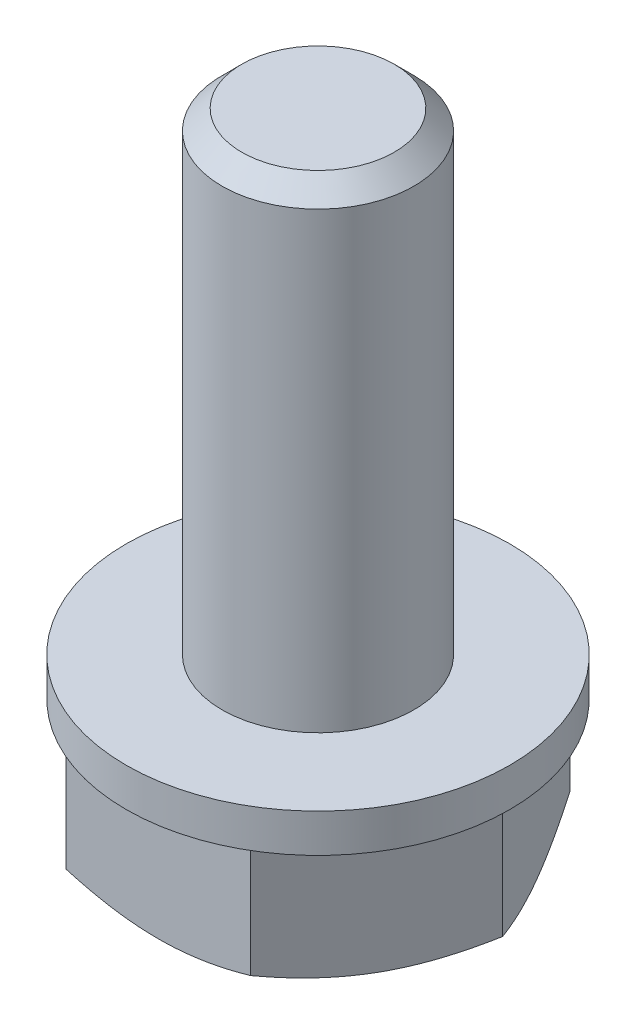
ISO-10303-21;
HEADER;
FILE_DESCRIPTION(('STEP AP214'),'2;1');
FILE_NAME('part.step','',(''),(''),'','','');
FILE_SCHEMA(('AUTOMOTIVE_DESIGN { 1 0 10303 214 1 1 1 1 }'));
ENDSEC;
DATA;
#1=APPLICATION_CONTEXT('core data for automotive mechanical design processes');
#2=APPLICATION_PROTOCOL_DEFINITION('international standard','automotive_design',2000,#1);
#3=PRODUCT_CONTEXT('',#1,'mechanical');
#4=PRODUCT('Part','Part','',(#3));
#5=PRODUCT_RELATED_PRODUCT_CATEGORY('part','',(#4));
#6=PRODUCT_DEFINITION_FORMATION('','',#4);
#7=PRODUCT_DEFINITION_CONTEXT('part definition',#1,'design');
#8=PRODUCT_DEFINITION('design','',#6,#7);
#9=PRODUCT_DEFINITION_SHAPE('','',#8);
#10=(LENGTH_UNIT() NAMED_UNIT(*) SI_UNIT(.MILLI.,.METRE.));
#11=(NAMED_UNIT(*) PLANE_ANGLE_UNIT() SI_UNIT($,.RADIAN.));
#12=(NAMED_UNIT(*) SI_UNIT($,.STERADIAN.) SOLID_ANGLE_UNIT());
#13=UNCERTAINTY_MEASURE_WITH_UNIT(LENGTH_MEASURE(1.E-05),#10,'distance_accuracy_value','');
#14=(GEOMETRIC_REPRESENTATION_CONTEXT(3) GLOBAL_UNCERTAINTY_ASSIGNED_CONTEXT((#13)) GLOBAL_UNIT_ASSIGNED_CONTEXT((#10,
#11,#12)) REPRESENTATION_CONTEXT('',''));
#15=CARTESIAN_POINT('',(0.,0.,0.));
#16=DIRECTION('',(0.,0.,1.));
#17=DIRECTION('',(1.,0.,0.));
#18=AXIS2_PLACEMENT_3D('',#15,#16,#17);
#19=CARTESIAN_POINT('',(17.677669529664,-54.8,15.177669529664));
#20=DIRECTION('',(0.,-1.,0.));
#21=DIRECTION('',(0.,0.,-1.));
#22=AXIS2_PLACEMENT_3D('',#19,#20,#21);
#23=PLANE('',#22);
#24=CARTESIAN_POINT('',(17.677669529664,-54.8,17.677669529664));
#25=DIRECTION('',(0.,-1.,0.));
#26=DIRECTION('',(0.,0.,-1.));
#27=AXIS2_PLACEMENT_3D('',#24,#25,#26);
#28=CIRCLE('',#27,5.);
#29=CARTESIAN_POINT('',(17.677669529664,-54.8,12.677669529664));
#30=VERTEX_POINT('',#29);
#31=CARTESIAN_POINT('',(22.0077965485861,-54.8,15.1776695296639));
#32=VERTEX_POINT('',#31);
#33=EDGE_CURVE('E106',#30,#32,#28,.T.);
#34=ORIENTED_EDGE('',*,*,#33,.T.);
#35=CARTESIAN_POINT('',(17.677669529664,-54.8,17.677669529664));
#36=DIRECTION('',(0.,-1.,0.));
#37=DIRECTION('',(0.,0.,-1.));
#38=AXIS2_PLACEMENT_3D('',#35,#36,#37);
#39=CIRCLE('',#38,5.);
#40=CARTESIAN_POINT('',(22.0077965485861,-54.8,20.1776695296641));
#41=VERTEX_POINT('',#40);
#42=EDGE_CURVE('E95',#32,#41,#39,.T.);
#43=ORIENTED_EDGE('',*,*,#42,.T.);
#44=CARTESIAN_POINT('',(17.677669529664,-54.8,17.677669529664));
#45=DIRECTION('',(0.,-1.,0.));
#46=DIRECTION('',(0.,0.,-1.));
#47=AXIS2_PLACEMENT_3D('',#44,#45,#46);
#48=CIRCLE('',#47,5.);
#49=CARTESIAN_POINT('',(17.677669529664,-54.8,22.677669529664));
#50=VERTEX_POINT('',#49);
#51=EDGE_CURVE('E164',#41,#50,#48,.T.);
#52=ORIENTED_EDGE('',*,*,#51,.T.);
#53=CARTESIAN_POINT('',(17.677669529664,-54.8,17.677669529664));
#54=DIRECTION('',(0.,-1.,0.));
#55=DIRECTION('',(0.,0.,-1.));
#56=AXIS2_PLACEMENT_3D('',#53,#54,#55);
#57=CIRCLE('',#56,5.);
#58=CARTESIAN_POINT('',(13.3475425107418,-54.8,20.1776695296641));
#59=VERTEX_POINT('',#58);
#60=EDGE_CURVE('E79',#50,#59,#57,.T.);
#61=ORIENTED_EDGE('',*,*,#60,.T.);
#62=CARTESIAN_POINT('',(17.677669529664,-54.8,17.677669529664));
#63=DIRECTION('',(0.,-1.,0.));
#64=DIRECTION('',(0.,0.,-1.));
#65=AXIS2_PLACEMENT_3D('',#62,#63,#64);
#66=CIRCLE('',#65,5.);
#67=CARTESIAN_POINT('',(13.3475425107418,-54.8,15.1776695296639));
#68=VERTEX_POINT('',#67);
#69=EDGE_CURVE('E172',#59,#68,#66,.T.);
#70=ORIENTED_EDGE('',*,*,#69,.T.);
#71=CARTESIAN_POINT('',(17.677669529664,-54.8,17.677669529664));
#72=DIRECTION('',(0.,-1.,0.));
#73=DIRECTION('',(0.,0.,-1.));
#74=AXIS2_PLACEMENT_3D('',#71,#72,#73);
#75=CIRCLE('',#74,5.);
#76=EDGE_CURVE('E177',#68,#30,#75,.T.);
#77=ORIENTED_EDGE('',*,*,#76,.T.);
#78=EDGE_LOOP('',(#34,#43,#52,#61,#70,#77));
#79=FACE_BOUND('',#78,.T.);
#80=ADVANCED_FACE('F16',(#79),#23,.T.);
#81=CARTESIAN_POINT('',(17.677669529664,-51.9113248654052,17.677669529664));
#82=DIRECTION('',(0.,1.,0.));
#83=DIRECTION('',(0.,0.,-1.));
#84=AXIS2_PLACEMENT_3D('',#81,#82,#83);
#85=CYLINDRICAL_SURFACE('',#84,6.);
#86=CARTESIAN_POINT('',(17.677669529664,-49.6,17.677669529664));
#87=DIRECTION('',(0.,-1.,0.));
#88=DIRECTION('',(0.,0.,-1.));
#89=AXIS2_PLACEMENT_3D('',#86,#87,#88);
#90=CIRCLE('',#89,6.);
#91=CARTESIAN_POINT('',(17.677669529664,-49.6,11.677669529664));
#92=VERTEX_POINT('',#91);
#93=EDGE_CURVE('E11',#92,#92,#90,.T.);
#94=ORIENTED_EDGE('',*,*,#93,.T.);
#95=EDGE_LOOP('',(#94));
#96=FACE_BOUND('',#95,.T.);
#97=CARTESIAN_POINT('',(17.677669529664,-50.8,17.677669529664));
#98=DIRECTION('',(0.,1.,0.));
#99=DIRECTION('',(0.,0.,-1.));
#100=AXIS2_PLACEMENT_3D('',#97,#98,#99);
#101=CIRCLE('',#100,6.);
#102=CARTESIAN_POINT('',(17.677669529664,-50.8,11.677669529664));
#103=VERTEX_POINT('',#102);
#104=EDGE_CURVE('E171',#103,#103,#101,.T.);
#105=ORIENTED_EDGE('',*,*,#104,.T.);
#106=EDGE_LOOP('',(#105));
#107=FACE_BOUND('',#106,.T.);
#108=ADVANCED_FACE('F294',(#96,#107),#85,.T.);
#109=CARTESIAN_POINT('',(17.677669529664,-49.6,13.177669529664));
#110=DIRECTION('',(0.,1.,0.));
#111=DIRECTION('',(0.,0.,1.));
#112=AXIS2_PLACEMENT_3D('',#109,#110,#111);
#113=PLANE('',#112);
#114=CARTESIAN_POINT('',(17.677669529664,-49.6,17.677669529664));
#115=DIRECTION('',(0.,-1.,0.));
#116=DIRECTION('',(0.,0.,-1.));
#117=AXIS2_PLACEMENT_3D('',#114,#115,#116);
#118=CIRCLE('',#117,3.);
#119=CARTESIAN_POINT('',(17.677669529664,-49.6,14.677669529664));
#120=VERTEX_POINT('',#119);
#121=EDGE_CURVE('E26',#120,#120,#118,.T.);
#122=ORIENTED_EDGE('',*,*,#121,.T.);
#123=EDGE_LOOP('',(#122));
#124=FACE_BOUND('',#123,.T.);
#125=ORIENTED_EDGE('',*,*,#93,.F.);
#126=EDGE_LOOP('',(#125));
#127=FACE_BOUND('',#126,.T.);
#128=ADVANCED_FACE('F298',(#124,#127),#113,.T.);
#129=CARTESIAN_POINT('',(17.677669529664,-42.50675,17.677669529664));
#130=DIRECTION('',(0.,1.,0.));
#131=DIRECTION('',(0.,0.,-1.));
#132=AXIS2_PLACEMENT_3D('',#129,#130,#131);
#133=CYLINDRICAL_SURFACE('',#132,3.);
#134=CARTESIAN_POINT('',(17.677669529664,-35.4135,17.677669529664));
#135=DIRECTION('',(0.,-1.,0.));
#136=DIRECTION('',(0.,0.,-1.));
#137=AXIS2_PLACEMENT_3D('',#134,#135,#136);
#138=CIRCLE('',#137,3.);
#139=CARTESIAN_POINT('',(17.677669529664,-35.4135,14.677669529664));
#140=VERTEX_POINT('',#139);
#141=EDGE_CURVE('E20',#140,#140,#138,.T.);
#142=ORIENTED_EDGE('',*,*,#141,.T.);
#143=EDGE_LOOP('',(#142));
#144=FACE_BOUND('',#143,.T.);
#145=ORIENTED_EDGE('',*,*,#121,.F.);
#146=EDGE_LOOP('',(#145));
#147=FACE_BOUND('',#146,.T.);
#148=ADVANCED_FACE('F305',(#144,#147),#133,.T.);
#149=CARTESIAN_POINT('',(17.677669529664,-35.10675,17.677669529664));
#150=DIRECTION('',(0.,-1.,0.));
#151=DIRECTION('',(0.,0.,-1.));
#152=AXIS2_PLACEMENT_3D('',#149,#150,#151);
#153=CONICAL_SURFACE('',#152,2.69325,0.785398163397448);
#154=CARTESIAN_POINT('',(17.677669529664,-34.8,17.677669529664));
#155=DIRECTION('',(0.,-1.,0.));
#156=DIRECTION('',(0.,0.,-1.));
#157=AXIS2_PLACEMENT_3D('',#154,#155,#156);
#158=CIRCLE('',#157,2.3865);
#159=CARTESIAN_POINT('',(17.677669529664,-34.8,15.291169529664));
#160=VERTEX_POINT('',#159);
#161=EDGE_CURVE('E170',#160,#160,#158,.T.);
#162=ORIENTED_EDGE('',*,*,#161,.T.);
#163=EDGE_LOOP('',(#162));
#164=FACE_BOUND('',#163,.T.);
#165=ORIENTED_EDGE('',*,*,#141,.F.);
#166=EDGE_LOOP('',(#165));
#167=FACE_BOUND('',#166,.T.);
#168=ADVANCED_FACE('F301',(#164,#167),#153,.T.);
#169=CARTESIAN_POINT('',(17.677669529664,-34.8,16.484419529664));
#170=DIRECTION('',(0.,1.,0.));
#171=DIRECTION('',(0.,0.,1.));
#172=AXIS2_PLACEMENT_3D('',#169,#170,#171);
#173=PLANE('',#172);
#174=ORIENTED_EDGE('',*,*,#161,.F.);
#175=EDGE_LOOP('',(#174));
#176=FACE_BOUND('',#175,.T.);
#177=ADVANCED_FACE('F304',(#176),#173,.T.);
#178=CARTESIAN_POINT('',(17.677669529664,-54.5113248654052,17.677669529664));
#179=DIRECTION('',(0.,1.,0.));
#180=DIRECTION('',(0.,0.,-1.));
#181=AXIS2_PLACEMENT_3D('',#178,#179,#180);
#182=CONICAL_SURFACE('',#181,5.5,1.04719755119662);
#183=CARTESIAN_POINT('',(17.677669529664,-54.8,22.677669529664));
#184=CARTESIAN_POINT('',(16.3379235675084,-54.8,22.677669529664));
#185=CARTESIAN_POINT('',(14.7909181837159,-54.3534180126148,22.677669529664));
#186=(BOUNDED_CURVE() B_SPLINE_CURVE(2,(#183,#184,#185),.UNSPECIFIED.,.F.,
.F.) B_SPLINE_CURVE_WITH_KNOTS((3,3),(3.37692975540509,6.36174641112158),
.UNSPECIFIED.) CURVE() GEOMETRIC_REPRESENTATION_ITEM() RATIONAL_B_SPLINE_CURVE((1.,
1.04314139574021,1.01001874935746)) REPRESENTATION_ITEM(''));
#187=CARTESIAN_POINT('',(14.7909181837159,-54.3534180126148,22.677669529664));
#188=VERTEX_POINT('',#187);
#189=EDGE_CURVE('E111',#50,#188,#186,.T.);
#190=ORIENTED_EDGE('',*,*,#189,.T.);
#191=CARTESIAN_POINT('',(14.7909181837159,-54.3534180126148,22.677669529664));
#192=CARTESIAN_POINT('',(14.0174154918196,-54.8,21.3379235675084));
#193=CARTESIAN_POINT('',(13.3475425107418,-54.8,20.1776695296641));
#194=(BOUNDED_CURVE() B_SPLINE_CURVE(2,(#191,#192,#193),.UNSPECIFIED.,.F.,
.F.) B_SPLINE_CURVE_WITH_KNOTS((3,3),(0.392113099688607,3.37692975540508),
.UNSPECIFIED.) CURVE() GEOMETRIC_REPRESENTATION_ITEM() RATIONAL_B_SPLINE_CURVE((1.01001874935746,
1.04314139574019,1.)) REPRESENTATION_ITEM(''));
#195=EDGE_CURVE('E156',#188,#59,#194,.T.);
#196=ORIENTED_EDGE('',*,*,#195,.T.);
#197=ORIENTED_EDGE('',*,*,#60,.F.);
#198=EDGE_LOOP('',(#190,#196,#197));
#199=FACE_BOUND('',#198,.T.);
#200=ADVANCED_FACE('F288',(#199),#182,.T.);
#201=CARTESIAN_POINT('',(17.677669529664,-54.5113248654052,17.677669529664));
#202=DIRECTION('',(0.,1.,0.));
#203=DIRECTION('',(0.,0.,-1.));
#204=AXIS2_PLACEMENT_3D('',#201,#202,#203);
#205=CONICAL_SURFACE('',#204,5.5,1.04719755119662);
#206=CARTESIAN_POINT('',(22.0077965485861,-54.8,20.1776695296641));
#207=CARTESIAN_POINT('',(21.3379235675084,-54.8000000000001,21.3379235675084));
#208=CARTESIAN_POINT('',(20.5644208756121,-54.3534180126148,22.677669529664));
#209=(BOUNDED_CURVE() B_SPLINE_CURVE(2,(#206,#207,#208),.UNSPECIFIED.,.F.,
.F.) B_SPLINE_CURVE_WITH_KNOTS((3,3),(3.37692975540508,6.36174641112157),
.UNSPECIFIED.) CURVE() GEOMETRIC_REPRESENTATION_ITEM() RATIONAL_B_SPLINE_CURVE((1.,
1.0431413957402,1.01001874935746)) REPRESENTATION_ITEM(''));
#210=CARTESIAN_POINT('',(20.5644208756121,-54.3534180126148,22.677669529664));
#211=VERTEX_POINT('',#210);
#212=EDGE_CURVE('E179',#41,#211,#209,.T.);
#213=ORIENTED_EDGE('',*,*,#212,.T.);
#214=CARTESIAN_POINT('',(20.5644208756121,-54.3534180126148,22.677669529664));
#215=CARTESIAN_POINT('',(19.0174154918196,-54.8,22.677669529664));
#216=CARTESIAN_POINT('',(17.677669529664,-54.8,22.677669529664));
#217=(BOUNDED_CURVE() B_SPLINE_CURVE(2,(#214,#215,#216),.UNSPECIFIED.,.F.,
.F.) B_SPLINE_CURVE_WITH_KNOTS((3,3),(0.392113099688602,3.37692975540509),
.UNSPECIFIED.) CURVE() GEOMETRIC_REPRESENTATION_ITEM() RATIONAL_B_SPLINE_CURVE((1.01001874935746,
1.04314139574021,1.)) REPRESENTATION_ITEM(''));
#218=EDGE_CURVE('E144',#211,#50,#217,.T.);
#219=ORIENTED_EDGE('',*,*,#218,.T.);
#220=ORIENTED_EDGE('',*,*,#51,.F.);
#221=EDGE_LOOP('',(#213,#219,#220));
#222=FACE_BOUND('',#221,.T.);
#223=ADVANCED_FACE('F281',(#222),#205,.T.);
#224=CARTESIAN_POINT('',(17.677669529664,-54.5113248654052,17.677669529664));
#225=DIRECTION('',(0.,1.,0.));
#226=DIRECTION('',(0.,0.,-1.));
#227=AXIS2_PLACEMENT_3D('',#224,#225,#226);
#228=CONICAL_SURFACE('',#227,5.5,1.04719755119662);
#229=CARTESIAN_POINT('',(22.0077965485861,-54.8,15.1776695296639));
#230=CARTESIAN_POINT('',(22.677669529664,-54.8,16.3379235675084));
#231=CARTESIAN_POINT('',(23.4511722215603,-54.3534180126148,17.677669529664));
#232=(BOUNDED_CURVE() B_SPLINE_CURVE(2,(#229,#230,#231),.UNSPECIFIED.,.F.,
.F.) B_SPLINE_CURVE_WITH_KNOTS((3,3),(3.37692975540508,6.36174641112167),
.UNSPECIFIED.) CURVE() GEOMETRIC_REPRESENTATION_ITEM() RATIONAL_B_SPLINE_CURVE((1.,
1.04314139574019,1.01001874935746)) REPRESENTATION_ITEM(''));
#233=CARTESIAN_POINT('',(23.4511722215603,-54.3534180126148,17.677669529664));
#234=VERTEX_POINT('',#233);
#235=EDGE_CURVE('E127',#32,#234,#232,.T.);
#236=ORIENTED_EDGE('',*,*,#235,.T.);
#237=CARTESIAN_POINT('',(23.4511722215603,-54.3534180126148,17.677669529664));
#238=CARTESIAN_POINT('',(22.677669529664,-54.8,19.0174154918197));
#239=CARTESIAN_POINT('',(22.0077965485861,-54.8,20.1776695296641));
#240=(BOUNDED_CURVE() B_SPLINE_CURVE(2,(#237,#238,#239),.UNSPECIFIED.,.F.,
.F.) B_SPLINE_CURVE_WITH_KNOTS((3,3),(0.392113099688502,3.37692975540508),
.UNSPECIFIED.) CURVE() GEOMETRIC_REPRESENTATION_ITEM() RATIONAL_B_SPLINE_CURVE((1.01001874935746,
1.04314139574019,1.)) REPRESENTATION_ITEM(''));
#241=EDGE_CURVE('E190',#234,#41,#240,.T.);
#242=ORIENTED_EDGE('',*,*,#241,.T.);
#243=ORIENTED_EDGE('',*,*,#42,.F.);
#244=EDGE_LOOP('',(#236,#242,#243));
#245=FACE_BOUND('',#244,.T.);
#246=ADVANCED_FACE('F279',(#245),#228,.T.);
#247=CARTESIAN_POINT('',(17.677669529664,-54.5113248654052,17.677669529664));
#248=DIRECTION('',(0.,1.,0.));
#249=DIRECTION('',(0.,0.,-1.));
#250=AXIS2_PLACEMENT_3D('',#247,#248,#249);
#251=CONICAL_SURFACE('',#250,5.5,1.04719755119662);
#252=CARTESIAN_POINT('',(20.5644208756121,-54.3534180126148,12.677669529664));
#253=CARTESIAN_POINT('',(21.3379235675084,-54.8,14.0174154918196));
#254=CARTESIAN_POINT('',(22.0077965485861,-54.8,15.1776695296639));
#255=(BOUNDED_CURVE() B_SPLINE_CURVE(2,(#252,#253,#254),.UNSPECIFIED.,.F.,
.F.) B_SPLINE_CURVE_WITH_KNOTS((3,3),(0.392113099688607,3.37692975540508),
.UNSPECIFIED.) CURVE() GEOMETRIC_REPRESENTATION_ITEM() RATIONAL_B_SPLINE_CURVE((1.01001874935746,
1.04314139574019,1.)) REPRESENTATION_ITEM(''));
#256=CARTESIAN_POINT('',(20.5644208756121,-54.3534180126148,12.677669529664));
#257=VERTEX_POINT('',#256);
#258=EDGE_CURVE('E105',#257,#32,#255,.T.);
#259=ORIENTED_EDGE('',*,*,#258,.T.);
#260=ORIENTED_EDGE('',*,*,#33,.F.);
#261=CARTESIAN_POINT('',(17.677669529664,-54.8,12.677669529664));
#262=CARTESIAN_POINT('',(19.0174154918196,-54.8,12.677669529664));
#263=CARTESIAN_POINT('',(20.5644208756121,-54.3534180126148,12.677669529664));
#264=(BOUNDED_CURVE() B_SPLINE_CURVE(2,(#261,#262,#263),.UNSPECIFIED.,.F.,
.F.) B_SPLINE_CURVE_WITH_KNOTS((3,3),(3.37692975540509,6.36174641112158),
.UNSPECIFIED.) CURVE() GEOMETRIC_REPRESENTATION_ITEM() RATIONAL_B_SPLINE_CURVE((1.,
1.04314139574021,1.01001874935746)) REPRESENTATION_ITEM(''));
#265=EDGE_CURVE('E101',#30,#257,#264,.T.);
#266=ORIENTED_EDGE('',*,*,#265,.T.);
#267=EDGE_LOOP('',(#259,#260,#266));
#268=FACE_BOUND('',#267,.T.);
#269=ADVANCED_FACE('F103',(#268),#251,.T.);
#270=CARTESIAN_POINT('',(17.677669529664,-54.5113248654052,17.677669529664));
#271=DIRECTION('',(0.,1.,0.));
#272=DIRECTION('',(0.,0.,-1.));
#273=AXIS2_PLACEMENT_3D('',#270,#271,#272);
#274=CONICAL_SURFACE('',#273,5.5,1.04719755119662);
#275=CARTESIAN_POINT('',(14.7909181837159,-54.3534180126148,12.677669529664));
#276=CARTESIAN_POINT('',(16.3379235675084,-54.8,12.677669529664));
#277=CARTESIAN_POINT('',(17.677669529664,-54.8,12.677669529664));
#278=(BOUNDED_CURVE() B_SPLINE_CURVE(2,(#275,#276,#277),.UNSPECIFIED.,.F.,
.F.) B_SPLINE_CURVE_WITH_KNOTS((3,3),(0.392113099688602,3.37692975540509),
.UNSPECIFIED.) CURVE() GEOMETRIC_REPRESENTATION_ITEM() RATIONAL_B_SPLINE_CURVE((1.01001874935746,
1.04314139574021,1.)) REPRESENTATION_ITEM(''));
#279=CARTESIAN_POINT('',(14.7909181837159,-54.3534180126148,12.677669529664));
#280=VERTEX_POINT('',#279);
#281=EDGE_CURVE('E110',#280,#30,#278,.T.);
#282=ORIENTED_EDGE('',*,*,#281,.T.);
#283=ORIENTED_EDGE('',*,*,#76,.F.);
#284=CARTESIAN_POINT('',(13.3475425107418,-54.8,15.1776695296639));
#285=CARTESIAN_POINT('',(14.0174154918197,-54.8000000000001,14.0174154918196));
#286=CARTESIAN_POINT('',(14.7909181837159,-54.3534180126148,12.677669529664));
#287=(BOUNDED_CURVE() B_SPLINE_CURVE(2,(#284,#285,#286),.UNSPECIFIED.,.F.,
.F.) B_SPLINE_CURVE_WITH_KNOTS((3,3),(3.37692975540508,6.36174641112157),
.UNSPECIFIED.) CURVE() GEOMETRIC_REPRESENTATION_ITEM() RATIONAL_B_SPLINE_CURVE((1.,
1.0431413957402,1.01001874935746)) REPRESENTATION_ITEM(''));
#288=EDGE_CURVE('E205',#68,#280,#287,.T.);
#289=ORIENTED_EDGE('',*,*,#288,.T.);
#290=EDGE_LOOP('',(#282,#283,#289));
#291=FACE_BOUND('',#290,.T.);
#292=ADVANCED_FACE('F262',(#291),#274,.T.);
#293=CARTESIAN_POINT('',(17.677669529664,-54.5113248654052,17.677669529664));
#294=DIRECTION('',(0.,1.,0.));
#295=DIRECTION('',(0.,0.,-1.));
#296=AXIS2_PLACEMENT_3D('',#293,#294,#295);
#297=CONICAL_SURFACE('',#296,5.5,1.04719755119662);
#298=CARTESIAN_POINT('',(11.9041668377677,-54.3534180126148,17.677669529664));
#299=CARTESIAN_POINT('',(12.677669529664,-54.8,16.3379235675083));
#300=CARTESIAN_POINT('',(13.3475425107418,-54.8,15.1776695296639));
#301=(BOUNDED_CURVE() B_SPLINE_CURVE(2,(#298,#299,#300),.UNSPECIFIED.,.F.,
.F.) B_SPLINE_CURVE_WITH_KNOTS((3,3),(0.392113099688502,3.37692975540508),
.UNSPECIFIED.) CURVE() GEOMETRIC_REPRESENTATION_ITEM() RATIONAL_B_SPLINE_CURVE((1.01001874935746,
1.04314139574019,1.)) REPRESENTATION_ITEM(''));
#302=CARTESIAN_POINT('',(11.9041668377677,-54.3534180126148,17.677669529664));
#303=VERTEX_POINT('',#302);
#304=EDGE_CURVE('E199',#303,#68,#301,.T.);
#305=ORIENTED_EDGE('',*,*,#304,.T.);
#306=ORIENTED_EDGE('',*,*,#69,.F.);
#307=CARTESIAN_POINT('',(13.3475425107418,-54.8,20.1776695296641));
#308=CARTESIAN_POINT('',(12.677669529664,-54.8,19.0174154918197));
#309=CARTESIAN_POINT('',(11.9041668377677,-54.3534180126148,17.677669529664));
#310=(BOUNDED_CURVE() B_SPLINE_CURVE(2,(#307,#308,#309),.UNSPECIFIED.,.F.,
.F.) B_SPLINE_CURVE_WITH_KNOTS((3,3),(3.37692975540508,6.36174641112167),
.UNSPECIFIED.) CURVE() GEOMETRIC_REPRESENTATION_ITEM() RATIONAL_B_SPLINE_CURVE((1.,
1.04314139574019,1.01001874935746)) REPRESENTATION_ITEM(''));
#311=EDGE_CURVE('E163',#59,#303,#310,.T.);
#312=ORIENTED_EDGE('',*,*,#311,.T.);
#313=EDGE_LOOP('',(#305,#306,#312));
#314=FACE_BOUND('',#313,.T.);
#315=ADVANCED_FACE('F18',(#314),#297,.T.);
#316=CARTESIAN_POINT('',(17.677669529664,-50.8,17.677669529664));
#317=DIRECTION('',(0.,-1.,0.));
#318=DIRECTION('',(-1.,0.,0.));
#319=AXIS2_PLACEMENT_3D('',#316,#317,#318);
#320=PLANE('',#319);
#321=DIRECTION('',(0.500000000000009,0.,-0.866025403784433));
#322=VECTOR('',#321,1.);
#323=CARTESIAN_POINT('',(23.4511722215603,-50.8,17.677669529664));
#324=LINE('',#323,#322);
#325=CARTESIAN_POINT('',(20.5644208756121,-50.8,22.677669529664));
#326=VERTEX_POINT('',#325);
#327=CARTESIAN_POINT('',(23.4511722215603,-50.8,17.677669529664));
#328=VERTEX_POINT('',#327);
#329=EDGE_CURVE('E185',#326,#328,#324,.T.);
#330=ORIENTED_EDGE('',*,*,#329,.T.);
#331=DIRECTION('',(-0.500000000000009,0.,-0.866025403784433));
#332=VECTOR('',#331,1.);
#333=CARTESIAN_POINT('',(20.5644208756121,-50.8,12.677669529664));
#334=LINE('',#333,#332);
#335=CARTESIAN_POINT('',(20.5644208756121,-50.8,12.677669529664));
#336=VERTEX_POINT('',#335);
#337=EDGE_CURVE('E122',#328,#336,#334,.T.);
#338=ORIENTED_EDGE('',*,*,#337,.T.);
#339=DIRECTION('',(-1.,0.,0.));
#340=VECTOR('',#339,1.);
#341=CARTESIAN_POINT('',(14.7909181837159,-50.8,12.677669529664));
#342=LINE('',#341,#340);
#343=CARTESIAN_POINT('',(14.7909181837159,-50.8,12.677669529664));
#344=VERTEX_POINT('',#343);
#345=EDGE_CURVE('E118',#336,#344,#342,.T.);
#346=ORIENTED_EDGE('',*,*,#345,.T.);
#347=DIRECTION('',(-0.500000000000009,0.,0.866025403784433));
#348=VECTOR('',#347,1.);
#349=CARTESIAN_POINT('',(11.9041668377677,-50.8,17.677669529664));
#350=LINE('',#349,#348);
#351=CARTESIAN_POINT('',(11.9041668377677,-50.8,17.677669529664));
#352=VERTEX_POINT('',#351);
#353=EDGE_CURVE('E133',#344,#352,#350,.T.);
#354=ORIENTED_EDGE('',*,*,#353,.T.);
#355=DIRECTION('',(0.500000000000009,0.,0.866025403784433));
#356=VECTOR('',#355,1.);
#357=CARTESIAN_POINT('',(14.7909181837159,-50.8,22.677669529664));
#358=LINE('',#357,#356);
#359=CARTESIAN_POINT('',(14.7909181837159,-50.8,22.677669529664));
#360=VERTEX_POINT('',#359);
#361=EDGE_CURVE('E85',#352,#360,#358,.T.);
#362=ORIENTED_EDGE('',*,*,#361,.T.);
#363=DIRECTION('',(1.,0.,0.));
#364=VECTOR('',#363,1.);
#365=CARTESIAN_POINT('',(20.5644208756121,-50.8,22.677669529664));
#366=LINE('',#365,#364);
#367=EDGE_CURVE('E141',#360,#326,#366,.T.);
#368=ORIENTED_EDGE('',*,*,#367,.T.);
#369=EDGE_LOOP('',(#330,#338,#346,#354,#362,#368));
#370=FACE_BOUND('',#369,.T.);
#371=ORIENTED_EDGE('',*,*,#104,.F.);
#372=EDGE_LOOP('',(#371));
#373=FACE_BOUND('',#372,.T.);
#374=ADVANCED_FACE('F272',(#370,#373),#320,.T.);
#375=CARTESIAN_POINT('',(11.9041668377677,-54.8,17.677669529664));
#376=DIRECTION('',(0.866025403784433,0.,-0.500000000000009));
#377=DIRECTION('',(-0.500000000000009,0.,-0.866025403784433));
#378=AXIS2_PLACEMENT_3D('',#375,#376,#377);
#379=PLANE('',#378);
#380=ORIENTED_EDGE('',*,*,#311,.F.);
#381=ORIENTED_EDGE('',*,*,#195,.F.);
#382=DIRECTION('',(0.,1.,0.));
#383=VECTOR('',#382,1.);
#384=CARTESIAN_POINT('',(14.7909181837159,-54.8,22.677669529664));
#385=LINE('',#384,#383);
#386=EDGE_CURVE('E143',#188,#360,#385,.T.);
#387=ORIENTED_EDGE('',*,*,#386,.T.);
#388=ORIENTED_EDGE('',*,*,#361,.F.);
#389=DIRECTION('',(0.,1.,0.));
#390=VECTOR('',#389,1.);
#391=CARTESIAN_POINT('',(11.9041668377677,-54.8,17.677669529664));
#392=LINE('',#391,#390);
#393=EDGE_CURVE('E204',#303,#352,#392,.T.);
#394=ORIENTED_EDGE('',*,*,#393,.F.);
#395=EDGE_LOOP('',(#380,#381,#387,#388,#394));
#396=FACE_BOUND('',#395,.T.);
#397=ADVANCED_FACE('F269',(#396),#379,.F.);
#398=CARTESIAN_POINT('',(14.7909181837159,-54.8,12.677669529664));
#399=DIRECTION('',(0.866025403784433,0.,0.500000000000009));
#400=DIRECTION('',(0.500000000000009,0.,-0.866025403784433));
#401=AXIS2_PLACEMENT_3D('',#398,#399,#400);
#402=PLANE('',#401);
#403=ORIENTED_EDGE('',*,*,#288,.F.);
#404=ORIENTED_EDGE('',*,*,#304,.F.);
#405=ORIENTED_EDGE('',*,*,#393,.T.);
#406=ORIENTED_EDGE('',*,*,#353,.F.);
#407=DIRECTION('',(0.,1.,0.));
#408=VECTOR('',#407,1.);
#409=CARTESIAN_POINT('',(14.7909181837159,-54.8,12.677669529664));
#410=LINE('',#409,#408);
#411=EDGE_CURVE('E155',#280,#344,#410,.T.);
#412=ORIENTED_EDGE('',*,*,#411,.F.);
#413=EDGE_LOOP('',(#403,#404,#405,#406,#412));
#414=FACE_BOUND('',#413,.T.);
#415=ADVANCED_FACE('F253',(#414),#402,.F.);
#416=CARTESIAN_POINT('',(20.5644208756121,-54.8,12.677669529664));
#417=DIRECTION('',(0.,0.,1.));
#418=DIRECTION('',(1.,0.,0.));
#419=AXIS2_PLACEMENT_3D('',#416,#417,#418);
#420=PLANE('',#419);
#421=ORIENTED_EDGE('',*,*,#265,.F.);
#422=ORIENTED_EDGE('',*,*,#281,.F.);
#423=ORIENTED_EDGE('',*,*,#411,.T.);
#424=ORIENTED_EDGE('',*,*,#345,.F.);
#425=DIRECTION('',(0.,1.,0.));
#426=VECTOR('',#425,1.);
#427=CARTESIAN_POINT('',(20.5644208756121,-54.8,12.677669529664));
#428=LINE('',#427,#426);
#429=EDGE_CURVE('E114',#257,#336,#428,.T.);
#430=ORIENTED_EDGE('',*,*,#429,.F.);
#431=EDGE_LOOP('',(#421,#422,#423,#424,#430));
#432=FACE_BOUND('',#431,.T.);
#433=ADVANCED_FACE('F115',(#432),#420,.F.);
#434=CARTESIAN_POINT('',(14.7909181837159,-54.8,22.677669529664));
#435=DIRECTION('',(0.,0.,-1.));
#436=DIRECTION('',(-1.,0.,0.));
#437=AXIS2_PLACEMENT_3D('',#434,#435,#436);
#438=PLANE('',#437);
#439=ORIENTED_EDGE('',*,*,#218,.F.);
#440=DIRECTION('',(0.,1.,0.));
#441=VECTOR('',#440,1.);
#442=CARTESIAN_POINT('',(20.5644208756121,-54.8,22.677669529664));
#443=LINE('',#442,#441);
#444=EDGE_CURVE('E184',#211,#326,#443,.T.);
#445=ORIENTED_EDGE('',*,*,#444,.T.);
#446=ORIENTED_EDGE('',*,*,#367,.F.);
#447=ORIENTED_EDGE('',*,*,#386,.F.);
#448=ORIENTED_EDGE('',*,*,#189,.F.);
#449=EDGE_LOOP('',(#439,#445,#446,#447,#448));
#450=FACE_BOUND('',#449,.T.);
#451=ADVANCED_FACE('F321',(#450),#438,.F.);
#452=CARTESIAN_POINT('',(20.5644208756121,-54.8,22.677669529664));
#453=DIRECTION('',(-0.866025403784433,0.,-0.500000000000009));
#454=DIRECTION('',(-0.500000000000009,0.,0.866025403784433));
#455=AXIS2_PLACEMENT_3D('',#452,#453,#454);
#456=PLANE('',#455);
#457=ORIENTED_EDGE('',*,*,#241,.F.);
#458=DIRECTION('',(0.,1.,0.));
#459=VECTOR('',#458,1.);
#460=CARTESIAN_POINT('',(23.4511722215603,-54.8,17.677669529664));
#461=LINE('',#460,#459);
#462=EDGE_CURVE('E135',#234,#328,#461,.T.);
#463=ORIENTED_EDGE('',*,*,#462,.T.);
#464=ORIENTED_EDGE('',*,*,#329,.F.);
#465=ORIENTED_EDGE('',*,*,#444,.F.);
#466=ORIENTED_EDGE('',*,*,#212,.F.);
#467=EDGE_LOOP('',(#457,#463,#464,#465,#466));
#468=FACE_BOUND('',#467,.T.);
#469=ADVANCED_FACE('F276',(#468),#456,.F.);
#470=CARTESIAN_POINT('',(23.4511722215603,-54.8,17.677669529664));
#471=DIRECTION('',(-0.866025403784433,0.,0.500000000000009));
#472=DIRECTION('',(0.500000000000009,0.,0.866025403784433));
#473=AXIS2_PLACEMENT_3D('',#470,#471,#472);
#474=PLANE('',#473);
#475=ORIENTED_EDGE('',*,*,#258,.F.);
#476=ORIENTED_EDGE('',*,*,#429,.T.);
#477=ORIENTED_EDGE('',*,*,#337,.F.);
#478=ORIENTED_EDGE('',*,*,#462,.F.);
#479=ORIENTED_EDGE('',*,*,#235,.F.);
#480=EDGE_LOOP('',(#475,#476,#477,#478,#479));
#481=FACE_BOUND('',#480,.T.);
#482=ADVANCED_FACE('F125',(#481),#474,.F.);
#483=CLOSED_SHELL('',(#80,#108,#128,#148,#168,#177,#200,#223,#246,#269,#292,#315,#374,#397,#415,
#433,#451,#469,#482));
#484=MANIFOLD_SOLID_BREP('B1',#483);
#485=ADVANCED_BREP_SHAPE_REPRESENTATION('',(#18,#484),#14);
#486=SHAPE_DEFINITION_REPRESENTATION(#9,#485);
ENDSEC;
END-ISO-10303-21;
